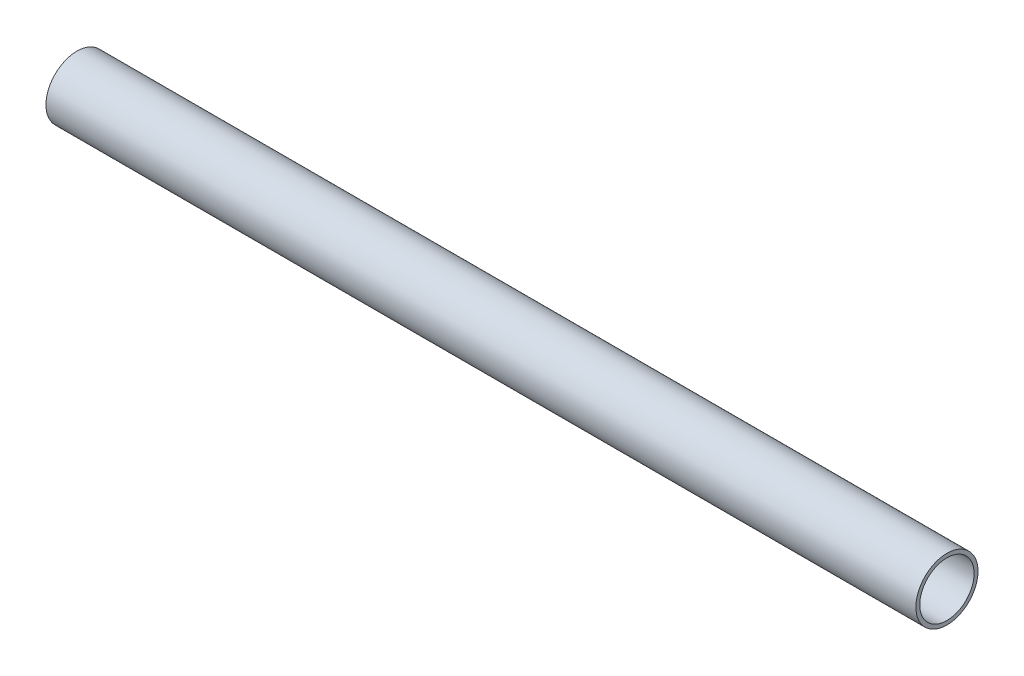
ISO-10303-21;
HEADER;
FILE_DESCRIPTION(('STEP AP214'),'2;1');
FILE_NAME('part.step','',(''),(''),'','','');
FILE_SCHEMA(('AUTOMOTIVE_DESIGN { 1 0 10303 214 1 1 1 1 }'));
ENDSEC;
DATA;
#1=APPLICATION_CONTEXT('core data for automotive mechanical design processes');
#2=APPLICATION_PROTOCOL_DEFINITION('international standard','automotive_design',2000,#1);
#3=PRODUCT_CONTEXT('',#1,'mechanical');
#4=PRODUCT('Part','Part','',(#3));
#5=PRODUCT_RELATED_PRODUCT_CATEGORY('part','',(#4));
#6=PRODUCT_DEFINITION_FORMATION('','',#4);
#7=PRODUCT_DEFINITION_CONTEXT('part definition',#1,'design');
#8=PRODUCT_DEFINITION('design','',#6,#7);
#9=PRODUCT_DEFINITION_SHAPE('','',#8);
#10=(LENGTH_UNIT() NAMED_UNIT(*) SI_UNIT(.MILLI.,.METRE.));
#11=(NAMED_UNIT(*) PLANE_ANGLE_UNIT() SI_UNIT($,.RADIAN.));
#12=(NAMED_UNIT(*) SI_UNIT($,.STERADIAN.) SOLID_ANGLE_UNIT());
#13=UNCERTAINTY_MEASURE_WITH_UNIT(LENGTH_MEASURE(1.E-05),#10,'distance_accuracy_value','');
#14=(GEOMETRIC_REPRESENTATION_CONTEXT(3) GLOBAL_UNCERTAINTY_ASSIGNED_CONTEXT((#13)) GLOBAL_UNIT_ASSIGNED_CONTEXT((#10,
#11,#12)) REPRESENTATION_CONTEXT('',''));
#15=CARTESIAN_POINT('',(0.,0.,0.));
#16=DIRECTION('',(0.,0.,1.));
#17=DIRECTION('',(1.,0.,0.));
#18=AXIS2_PLACEMENT_3D('',#15,#16,#17);
#19=CARTESIAN_POINT('',(355.6,0.,0.));
#20=DIRECTION('',(1.,0.,0.));
#21=DIRECTION('',(0.,0.,-1.));
#22=AXIS2_PLACEMENT_3D('',#19,#20,#21);
#23=PLANE('',#22);
#24=CARTESIAN_POINT('',(355.6,0.,0.));
#25=DIRECTION('',(1.,0.,0.));
#26=DIRECTION('',(0.,0.,-1.));
#27=AXIS2_PLACEMENT_3D('',#24,#25,#26);
#28=CIRCLE('',#27,12.7);
#29=CARTESIAN_POINT('',(355.6,0.,-12.7));
#30=VERTEX_POINT('',#29);
#31=EDGE_CURVE('E10',#30,#30,#28,.T.);
#32=ORIENTED_EDGE('',*,*,#31,.T.);
#33=EDGE_LOOP('',(#32));
#34=FACE_BOUND('',#33,.T.);
#35=CARTESIAN_POINT('',(355.6,0.,0.));
#36=DIRECTION('',(1.,0.,0.));
#37=DIRECTION('',(0.,0.,-1.));
#38=AXIS2_PLACEMENT_3D('',#35,#36,#37);
#39=CIRCLE('',#38,11.1125);
#40=CARTESIAN_POINT('',(355.6,0.,-11.1125));
#41=VERTEX_POINT('',#40);
#42=EDGE_CURVE('E50',#41,#41,#39,.T.);
#43=ORIENTED_EDGE('',*,*,#42,.F.);
#44=EDGE_LOOP('',(#43));
#45=FACE_BOUND('',#44,.T.);
#46=ADVANCED_FACE('F37',(#34,#45),#23,.T.);
#47=CARTESIAN_POINT('',(0.,0.,0.));
#48=DIRECTION('',(1.,0.,0.));
#49=DIRECTION('',(0.,0.,-1.));
#50=AXIS2_PLACEMENT_3D('',#47,#48,#49);
#51=PLANE('',#50);
#52=CARTESIAN_POINT('',(0.,0.,0.));
#53=DIRECTION('',(1.,0.,0.));
#54=DIRECTION('',(0.,0.,-1.));
#55=AXIS2_PLACEMENT_3D('',#52,#53,#54);
#56=CIRCLE('',#55,12.7);
#57=CARTESIAN_POINT('',(0.,0.,-12.7));
#58=VERTEX_POINT('',#57);
#59=EDGE_CURVE('E41',#58,#58,#56,.T.);
#60=ORIENTED_EDGE('',*,*,#59,.F.);
#61=EDGE_LOOP('',(#60));
#62=FACE_BOUND('',#61,.T.);
#63=CARTESIAN_POINT('',(0.,0.,0.));
#64=DIRECTION('',(1.,0.,0.));
#65=DIRECTION('',(0.,0.,-1.));
#66=AXIS2_PLACEMENT_3D('',#63,#64,#65);
#67=CIRCLE('',#66,11.1125);
#68=CARTESIAN_POINT('',(0.,0.,-11.1125));
#69=VERTEX_POINT('',#68);
#70=EDGE_CURVE('E52',#69,#69,#67,.T.);
#71=ORIENTED_EDGE('',*,*,#70,.T.);
#72=EDGE_LOOP('',(#71));
#73=FACE_BOUND('',#72,.T.);
#74=ADVANCED_FACE('F64',(#62,#73),#51,.F.);
#75=CARTESIAN_POINT('',(355.6,0.,0.));
#76=DIRECTION('',(-1.,0.,0.));
#77=DIRECTION('',(0.,0.,1.));
#78=AXIS2_PLACEMENT_3D('',#75,#76,#77);
#79=CYLINDRICAL_SURFACE('',#78,12.7);
#80=ORIENTED_EDGE('',*,*,#31,.F.);
#81=EDGE_LOOP('',(#80));
#82=FACE_BOUND('',#81,.T.);
#83=ORIENTED_EDGE('',*,*,#59,.T.);
#84=EDGE_LOOP('',(#83));
#85=FACE_BOUND('',#84,.T.);
#86=ADVANCED_FACE('F39',(#82,#85),#79,.T.);
#87=CARTESIAN_POINT('',(355.6,0.,0.));
#88=DIRECTION('',(-1.,0.,0.));
#89=DIRECTION('',(0.,0.,1.));
#90=AXIS2_PLACEMENT_3D('',#87,#88,#89);
#91=CYLINDRICAL_SURFACE('',#90,11.1125);
#92=ORIENTED_EDGE('',*,*,#42,.T.);
#93=EDGE_LOOP('',(#92));
#94=FACE_BOUND('',#93,.T.);
#95=ORIENTED_EDGE('',*,*,#70,.F.);
#96=EDGE_LOOP('',(#95));
#97=FACE_BOUND('',#96,.T.);
#98=ADVANCED_FACE('F60',(#94,#97),#91,.F.);
#99=CLOSED_SHELL('',(#46,#74,#86,#98));
#100=MANIFOLD_SOLID_BREP('B2',#99);
#101=ADVANCED_BREP_SHAPE_REPRESENTATION('',(#18,#100),#14);
#102=SHAPE_DEFINITION_REPRESENTATION(#9,#101);
ENDSEC;
END-ISO-10303-21;
